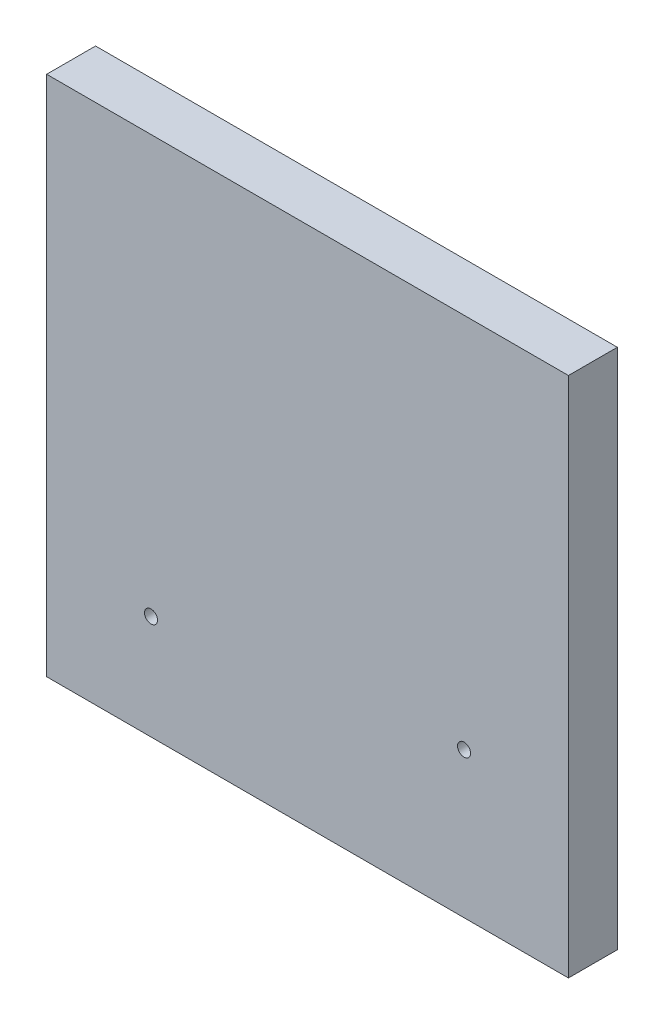
ISO-10303-21;
HEADER;
FILE_DESCRIPTION(('STEP AP214'),'2;1');
FILE_NAME('part.step','',(''),(''),'','','');
FILE_SCHEMA(('AUTOMOTIVE_DESIGN { 1 0 10303 214 1 1 1 1 }'));
ENDSEC;
DATA;
#1=APPLICATION_CONTEXT('core data for automotive mechanical design processes');
#2=APPLICATION_PROTOCOL_DEFINITION('international standard','automotive_design',2000,#1);
#3=PRODUCT_CONTEXT('',#1,'mechanical');
#4=PRODUCT('Part','Part','',(#3));
#5=PRODUCT_RELATED_PRODUCT_CATEGORY('part','',(#4));
#6=PRODUCT_DEFINITION_FORMATION('','',#4);
#7=PRODUCT_DEFINITION_CONTEXT('part definition',#1,'design');
#8=PRODUCT_DEFINITION('design','',#6,#7);
#9=PRODUCT_DEFINITION_SHAPE('','',#8);
#10=(LENGTH_UNIT() NAMED_UNIT(*) SI_UNIT(.MILLI.,.METRE.));
#11=(NAMED_UNIT(*) PLANE_ANGLE_UNIT() SI_UNIT($,.RADIAN.));
#12=(NAMED_UNIT(*) SI_UNIT($,.STERADIAN.) SOLID_ANGLE_UNIT());
#13=UNCERTAINTY_MEASURE_WITH_UNIT(LENGTH_MEASURE(1.E-05),#10,'distance_accuracy_value','');
#14=(GEOMETRIC_REPRESENTATION_CONTEXT(3) GLOBAL_UNCERTAINTY_ASSIGNED_CONTEXT((#13)) GLOBAL_UNIT_ASSIGNED_CONTEXT((#10,
#11,#12)) REPRESENTATION_CONTEXT('',''));
#15=CARTESIAN_POINT('',(0.,0.,0.));
#16=DIRECTION('',(0.,0.,1.));
#17=DIRECTION('',(1.,0.,0.));
#18=AXIS2_PLACEMENT_3D('',#15,#16,#17);
#19=CARTESIAN_POINT('',(0.,0.,11.90625));
#20=DIRECTION('',(0.,0.,-1.));
#21=DIRECTION('',(-1.,0.,0.));
#22=AXIS2_PLACEMENT_3D('',#19,#20,#21);
#23=PLANE('',#22);
#24=DIRECTION('',(0.,-1.,0.));
#25=VECTOR('',#24,1.);
#26=CARTESIAN_POINT('',(0.,0.,11.90625));
#27=LINE('',#26,#25);
#28=CARTESIAN_POINT('',(0.,127.,11.90625));
#29=VERTEX_POINT('',#28);
#30=CARTESIAN_POINT('',(0.,0.,11.90625));
#31=VERTEX_POINT('',#30);
#32=EDGE_CURVE('E92',#29,#31,#27,.T.);
#33=ORIENTED_EDGE('',*,*,#32,.T.);
#34=DIRECTION('',(1.,0.,0.));
#35=VECTOR('',#34,1.);
#36=CARTESIAN_POINT('',(0.,0.,11.90625));
#37=LINE('',#36,#35);
#38=CARTESIAN_POINT('',(127.,0.,11.90625));
#39=VERTEX_POINT('',#38);
#40=EDGE_CURVE('E87',#31,#39,#37,.T.);
#41=ORIENTED_EDGE('',*,*,#40,.T.);
#42=DIRECTION('',(0.,1.,0.));
#43=VECTOR('',#42,1.);
#44=CARTESIAN_POINT('',(127.,0.,11.90625));
#45=LINE('',#44,#43);
#46=CARTESIAN_POINT('',(127.,127.,11.90625));
#47=VERTEX_POINT('',#46);
#48=EDGE_CURVE('E90',#39,#47,#45,.T.);
#49=ORIENTED_EDGE('',*,*,#48,.T.);
#50=DIRECTION('',(-1.,0.,0.));
#51=VECTOR('',#50,1.);
#52=CARTESIAN_POINT('',(0.,127.,11.90625));
#53=LINE('',#52,#51);
#54=EDGE_CURVE('E57',#47,#29,#53,.T.);
#55=ORIENTED_EDGE('',*,*,#54,.T.);
#56=EDGE_LOOP('',(#33,#41,#49,#55));
#57=FACE_BOUND('',#56,.T.);
#58=CARTESIAN_POINT('',(25.4,25.4,11.90625));
#59=DIRECTION('',(0.,0.,1.));
#60=DIRECTION('',(1.,0.,0.));
#61=AXIS2_PLACEMENT_3D('',#58,#59,#60);
#62=CIRCLE('',#61,1.5875);
#63=CARTESIAN_POINT('',(26.9875,25.4,11.90625));
#64=VERTEX_POINT('',#63);
#65=EDGE_CURVE('E112',#64,#64,#62,.T.);
#66=ORIENTED_EDGE('',*,*,#65,.F.);
#67=EDGE_LOOP('',(#66));
#68=FACE_BOUND('',#67,.T.);
#69=CARTESIAN_POINT('',(101.6,35.433,11.90625));
#70=DIRECTION('',(0.,0.,1.));
#71=DIRECTION('',(1.,0.,0.));
#72=AXIS2_PLACEMENT_3D('',#69,#70,#71);
#73=CIRCLE('',#72,1.58749999999999);
#74=CARTESIAN_POINT('',(103.1875,35.433,11.90625));
#75=VERTEX_POINT('',#74);
#76=EDGE_CURVE('E134',#75,#75,#73,.T.);
#77=ORIENTED_EDGE('',*,*,#76,.F.);
#78=EDGE_LOOP('',(#77));
#79=FACE_BOUND('',#78,.T.);
#80=ADVANCED_FACE('F39',(#57,#68,#79),#23,.F.);
#81=CARTESIAN_POINT('',(0.,0.,0.));
#82=DIRECTION('',(0.,0.,-1.));
#83=DIRECTION('',(-1.,0.,0.));
#84=AXIS2_PLACEMENT_3D('',#81,#82,#83);
#85=PLANE('',#84);
#86=CARTESIAN_POINT('',(25.4,25.4,0.));
#87=DIRECTION('',(0.,0.,1.));
#88=DIRECTION('',(1.,0.,0.));
#89=AXIS2_PLACEMENT_3D('',#86,#87,#88);
#90=CIRCLE('',#89,1.5875);
#91=CARTESIAN_POINT('',(26.9875,25.4,0.));
#92=VERTEX_POINT('',#91);
#93=EDGE_CURVE('E130',#92,#92,#90,.T.);
#94=ORIENTED_EDGE('',*,*,#93,.T.);
#95=EDGE_LOOP('',(#94));
#96=FACE_BOUND('',#95,.T.);
#97=DIRECTION('',(0.,-1.,0.));
#98=VECTOR('',#97,1.);
#99=CARTESIAN_POINT('',(0.,0.,0.));
#100=LINE('',#99,#98);
#101=CARTESIAN_POINT('',(0.,127.,0.));
#102=VERTEX_POINT('',#101);
#103=CARTESIAN_POINT('',(0.,0.,0.));
#104=VERTEX_POINT('',#103);
#105=EDGE_CURVE('E108',#102,#104,#100,.T.);
#106=ORIENTED_EDGE('',*,*,#105,.F.);
#107=DIRECTION('',(-1.,0.,0.));
#108=VECTOR('',#107,1.);
#109=CARTESIAN_POINT('',(0.,127.,0.));
#110=LINE('',#109,#108);
#111=CARTESIAN_POINT('',(127.,127.,0.));
#112=VERTEX_POINT('',#111);
#113=EDGE_CURVE('E80',#112,#102,#110,.T.);
#114=ORIENTED_EDGE('',*,*,#113,.F.);
#115=DIRECTION('',(0.,1.,0.));
#116=VECTOR('',#115,1.);
#117=CARTESIAN_POINT('',(127.,0.,0.));
#118=LINE('',#117,#116);
#119=CARTESIAN_POINT('',(127.,0.,0.));
#120=VERTEX_POINT('',#119);
#121=EDGE_CURVE('E74',#120,#112,#118,.T.);
#122=ORIENTED_EDGE('',*,*,#121,.F.);
#123=DIRECTION('',(1.,0.,0.));
#124=VECTOR('',#123,1.);
#125=CARTESIAN_POINT('',(0.,0.,0.));
#126=LINE('',#125,#124);
#127=EDGE_CURVE('E97',#104,#120,#126,.T.);
#128=ORIENTED_EDGE('',*,*,#127,.F.);
#129=EDGE_LOOP('',(#106,#114,#122,#128));
#130=FACE_BOUND('',#129,.T.);
#131=CARTESIAN_POINT('',(101.6,35.433,0.));
#132=DIRECTION('',(0.,0.,1.));
#133=DIRECTION('',(1.,0.,0.));
#134=AXIS2_PLACEMENT_3D('',#131,#132,#133);
#135=CIRCLE('',#134,1.58749999999999);
#136=CARTESIAN_POINT('',(103.1875,35.433,0.));
#137=VERTEX_POINT('',#136);
#138=EDGE_CURVE('E138',#137,#137,#135,.T.);
#139=ORIENTED_EDGE('',*,*,#138,.T.);
#140=EDGE_LOOP('',(#139));
#141=FACE_BOUND('',#140,.T.);
#142=ADVANCED_FACE('F125',(#96,#130,#141),#85,.T.);
#143=CARTESIAN_POINT('',(0.,0.,11.90625));
#144=DIRECTION('',(1.,0.,0.));
#145=DIRECTION('',(0.,0.,-1.));
#146=AXIS2_PLACEMENT_3D('',#143,#144,#145);
#147=PLANE('',#146);
#148=ORIENTED_EDGE('',*,*,#105,.T.);
#149=DIRECTION('',(0.,0.,-1.));
#150=VECTOR('',#149,1.);
#151=CARTESIAN_POINT('',(0.,0.,11.90625));
#152=LINE('',#151,#150);
#153=EDGE_CURVE('E11',#31,#104,#152,.T.);
#154=ORIENTED_EDGE('',*,*,#153,.F.);
#155=ORIENTED_EDGE('',*,*,#32,.F.);
#156=DIRECTION('',(0.,0.,-1.));
#157=VECTOR('',#156,1.);
#158=CARTESIAN_POINT('',(0.,127.,11.90625));
#159=LINE('',#158,#157);
#160=EDGE_CURVE('E104',#29,#102,#159,.T.);
#161=ORIENTED_EDGE('',*,*,#160,.T.);
#162=EDGE_LOOP('',(#148,#154,#155,#161));
#163=FACE_BOUND('',#162,.T.);
#164=ADVANCED_FACE('F41',(#163),#147,.F.);
#165=CARTESIAN_POINT('',(0.,0.,11.90625));
#166=DIRECTION('',(0.,1.,0.));
#167=DIRECTION('',(0.,0.,1.));
#168=AXIS2_PLACEMENT_3D('',#165,#166,#167);
#169=PLANE('',#168);
#170=ORIENTED_EDGE('',*,*,#127,.T.);
#171=DIRECTION('',(0.,0.,-1.));
#172=VECTOR('',#171,1.);
#173=CARTESIAN_POINT('',(127.,0.,11.90625));
#174=LINE('',#173,#172);
#175=EDGE_CURVE('E49',#39,#120,#174,.T.);
#176=ORIENTED_EDGE('',*,*,#175,.F.);
#177=ORIENTED_EDGE('',*,*,#40,.F.);
#178=ORIENTED_EDGE('',*,*,#153,.T.);
#179=EDGE_LOOP('',(#170,#176,#177,#178));
#180=FACE_BOUND('',#179,.T.);
#181=ADVANCED_FACE('F96',(#180),#169,.F.);
#182=CARTESIAN_POINT('',(127.,0.,11.90625));
#183=DIRECTION('',(-1.,0.,0.));
#184=DIRECTION('',(0.,0.,1.));
#185=AXIS2_PLACEMENT_3D('',#182,#183,#184);
#186=PLANE('',#185);
#187=ORIENTED_EDGE('',*,*,#121,.T.);
#188=DIRECTION('',(0.,0.,-1.));
#189=VECTOR('',#188,1.);
#190=CARTESIAN_POINT('',(127.,127.,11.90625));
#191=LINE('',#190,#189);
#192=EDGE_CURVE('E99',#47,#112,#191,.T.);
#193=ORIENTED_EDGE('',*,*,#192,.F.);
#194=ORIENTED_EDGE('',*,*,#48,.F.);
#195=ORIENTED_EDGE('',*,*,#175,.T.);
#196=EDGE_LOOP('',(#187,#193,#194,#195));
#197=FACE_BOUND('',#196,.T.);
#198=ADVANCED_FACE('F100',(#197),#186,.F.);
#199=CARTESIAN_POINT('',(0.,127.,11.90625));
#200=DIRECTION('',(0.,-1.,0.));
#201=DIRECTION('',(0.,0.,-1.));
#202=AXIS2_PLACEMENT_3D('',#199,#200,#201);
#203=PLANE('',#202);
#204=ORIENTED_EDGE('',*,*,#113,.T.);
#205=ORIENTED_EDGE('',*,*,#160,.F.);
#206=ORIENTED_EDGE('',*,*,#54,.F.);
#207=ORIENTED_EDGE('',*,*,#192,.T.);
#208=EDGE_LOOP('',(#204,#205,#206,#207));
#209=FACE_BOUND('',#208,.T.);
#210=ADVANCED_FACE('F122',(#209),#203,.F.);
#211=CARTESIAN_POINT('',(25.4,25.4,11.90625));
#212=DIRECTION('',(0.,0.,-1.));
#213=DIRECTION('',(-1.,0.,0.));
#214=AXIS2_PLACEMENT_3D('',#211,#212,#213);
#215=CYLINDRICAL_SURFACE('',#214,1.5875);
#216=ORIENTED_EDGE('',*,*,#65,.T.);
#217=EDGE_LOOP('',(#216));
#218=FACE_BOUND('',#217,.T.);
#219=ORIENTED_EDGE('',*,*,#93,.F.);
#220=EDGE_LOOP('',(#219));
#221=FACE_BOUND('',#220,.T.);
#222=ADVANCED_FACE('F157',(#218,#221),#215,.F.);
#223=CARTESIAN_POINT('',(101.6,35.433,11.90625));
#224=DIRECTION('',(0.,0.,-1.));
#225=DIRECTION('',(-1.,0.,0.));
#226=AXIS2_PLACEMENT_3D('',#223,#224,#225);
#227=CYLINDRICAL_SURFACE('',#226,1.58749999999999);
#228=ORIENTED_EDGE('',*,*,#76,.T.);
#229=EDGE_LOOP('',(#228));
#230=FACE_BOUND('',#229,.T.);
#231=ORIENTED_EDGE('',*,*,#138,.F.);
#232=EDGE_LOOP('',(#231));
#233=FACE_BOUND('',#232,.T.);
#234=ADVANCED_FACE('F146',(#230,#233),#227,.F.);
#235=CLOSED_SHELL('',(#80,#142,#164,#181,#198,#210,#222,#234));
#236=MANIFOLD_SOLID_BREP('B2',#235);
#237=ADVANCED_BREP_SHAPE_REPRESENTATION('',(#18,#236),#14);
#238=SHAPE_DEFINITION_REPRESENTATION(#9,#237);
ENDSEC;
END-ISO-10303-21;
